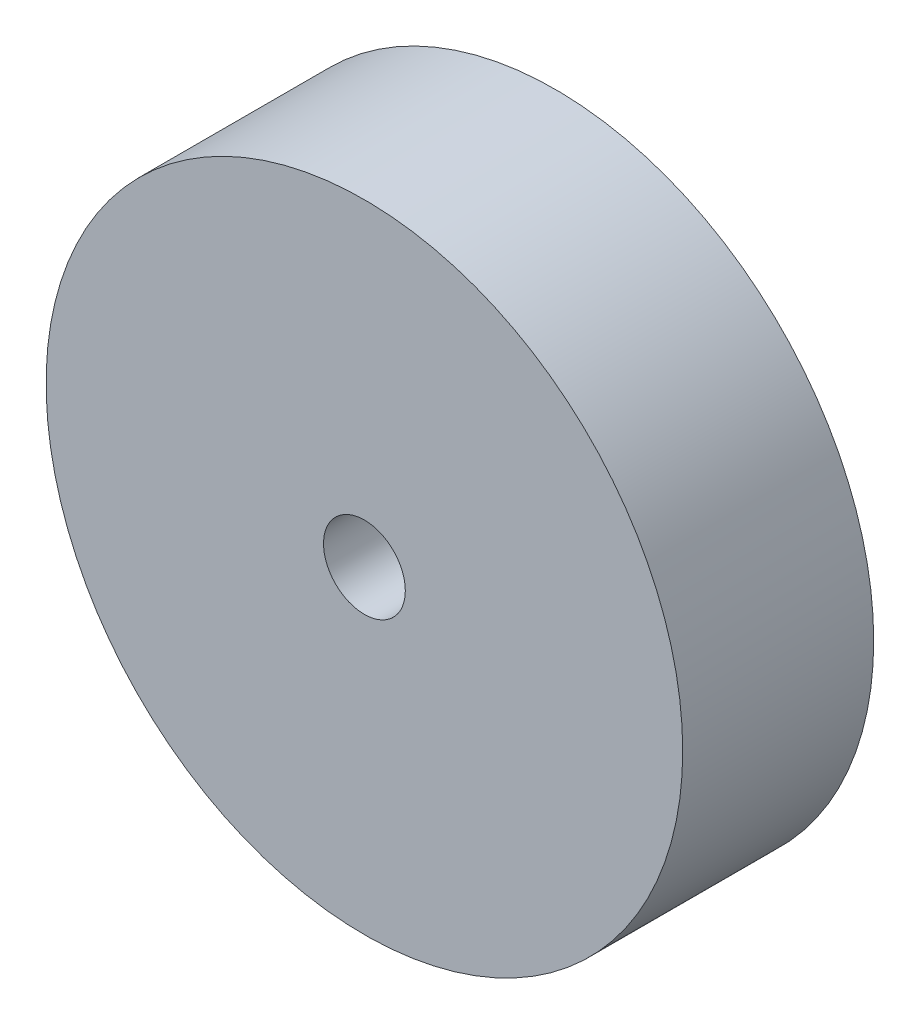
ISO-10303-21;
HEADER;
FILE_DESCRIPTION(('STEP AP214'),'2;1');
FILE_NAME('part.step','',(''),(''),'','','');
FILE_SCHEMA(('AUTOMOTIVE_DESIGN { 1 0 10303 214 1 1 1 1 }'));
ENDSEC;
DATA;
#1=APPLICATION_CONTEXT('core data for automotive mechanical design processes');
#2=APPLICATION_PROTOCOL_DEFINITION('international standard','automotive_design',2000,#1);
#3=PRODUCT_CONTEXT('',#1,'mechanical');
#4=PRODUCT('Part','Part','',(#3));
#5=PRODUCT_RELATED_PRODUCT_CATEGORY('part','',(#4));
#6=PRODUCT_DEFINITION_FORMATION('','',#4);
#7=PRODUCT_DEFINITION_CONTEXT('part definition',#1,'design');
#8=PRODUCT_DEFINITION('design','',#6,#7);
#9=PRODUCT_DEFINITION_SHAPE('','',#8);
#10=(LENGTH_UNIT() NAMED_UNIT(*) SI_UNIT(.MILLI.,.METRE.));
#11=(NAMED_UNIT(*) PLANE_ANGLE_UNIT() SI_UNIT($,.RADIAN.));
#12=(NAMED_UNIT(*) SI_UNIT($,.STERADIAN.) SOLID_ANGLE_UNIT());
#13=UNCERTAINTY_MEASURE_WITH_UNIT(LENGTH_MEASURE(1.E-05),#10,'distance_accuracy_value','');
#14=(GEOMETRIC_REPRESENTATION_CONTEXT(3) GLOBAL_UNCERTAINTY_ASSIGNED_CONTEXT((#13)) GLOBAL_UNIT_ASSIGNED_CONTEXT((#10,
#11,#12)) REPRESENTATION_CONTEXT('',''));
#15=CARTESIAN_POINT('',(0.,0.,0.));
#16=DIRECTION('',(0.,0.,1.));
#17=DIRECTION('',(1.,0.,0.));
#18=AXIS2_PLACEMENT_3D('',#15,#16,#17);
#19=CARTESIAN_POINT('',(0.,0.,7.62));
#20=DIRECTION('',(0.,0.,-1.));
#21=DIRECTION('',(-1.,0.,0.));
#22=AXIS2_PLACEMENT_3D('',#19,#20,#21);
#23=CYLINDRICAL_SURFACE('',#22,12.7);
#24=CARTESIAN_POINT('',(0.,0.,7.62));
#25=DIRECTION('',(0.,0.,1.));
#26=DIRECTION('',(1.,0.,0.));
#27=AXIS2_PLACEMENT_3D('',#24,#25,#26);
#28=CIRCLE('',#27,12.7);
#29=CARTESIAN_POINT('',(12.7,0.,7.62));
#30=VERTEX_POINT('',#29);
#31=EDGE_CURVE('E10',#30,#30,#28,.T.);
#32=ORIENTED_EDGE('',*,*,#31,.F.);
#33=EDGE_LOOP('',(#32));
#34=FACE_BOUND('',#33,.T.);
#35=CARTESIAN_POINT('',(0.,0.,0.));
#36=DIRECTION('',(0.,0.,1.));
#37=DIRECTION('',(1.,0.,0.));
#38=AXIS2_PLACEMENT_3D('',#35,#36,#37);
#39=CIRCLE('',#38,12.7);
#40=CARTESIAN_POINT('',(12.7,0.,0.));
#41=VERTEX_POINT('',#40);
#42=EDGE_CURVE('E34',#41,#41,#39,.T.);
#43=ORIENTED_EDGE('',*,*,#42,.T.);
#44=EDGE_LOOP('',(#43));
#45=FACE_BOUND('',#44,.T.);
#46=ADVANCED_FACE('F31',(#34,#45),#23,.T.);
#47=CARTESIAN_POINT('',(0.,0.,7.62));
#48=DIRECTION('',(0.,0.,1.));
#49=DIRECTION('',(1.,0.,0.));
#50=AXIS2_PLACEMENT_3D('',#47,#48,#49);
#51=PLANE('',#50);
#52=CARTESIAN_POINT('',(0.,0.,7.62));
#53=DIRECTION('',(0.,0.,1.));
#54=DIRECTION('',(1.,0.,0.));
#55=AXIS2_PLACEMENT_3D('',#52,#53,#54);
#56=CIRCLE('',#55,1.63194999999999);
#57=CARTESIAN_POINT('',(1.63194999999999,0.,7.62));
#58=VERTEX_POINT('',#57);
#59=EDGE_CURVE('E45',#58,#58,#56,.T.);
#60=ORIENTED_EDGE('',*,*,#59,.F.);
#61=EDGE_LOOP('',(#60));
#62=FACE_BOUND('',#61,.T.);
#63=ORIENTED_EDGE('',*,*,#31,.T.);
#64=EDGE_LOOP('',(#63));
#65=FACE_BOUND('',#64,.T.);
#66=ADVANCED_FACE('F51',(#62,#65),#51,.T.);
#67=CARTESIAN_POINT('',(0.,0.,0.));
#68=DIRECTION('',(0.,0.,1.));
#69=DIRECTION('',(1.,0.,0.));
#70=AXIS2_PLACEMENT_3D('',#67,#68,#69);
#71=PLANE('',#70);
#72=CARTESIAN_POINT('',(0.,0.,0.));
#73=DIRECTION('',(0.,0.,1.));
#74=DIRECTION('',(1.,0.,0.));
#75=AXIS2_PLACEMENT_3D('',#72,#73,#74);
#76=CIRCLE('',#75,1.63195);
#77=CARTESIAN_POINT('',(1.63195,0.,0.));
#78=VERTEX_POINT('',#77);
#79=EDGE_CURVE('E41',#78,#78,#76,.T.);
#80=ORIENTED_EDGE('',*,*,#79,.T.);
#81=EDGE_LOOP('',(#80));
#82=FACE_BOUND('',#81,.T.);
#83=ORIENTED_EDGE('',*,*,#42,.F.);
#84=EDGE_LOOP('',(#83));
#85=FACE_BOUND('',#84,.T.);
#86=ADVANCED_FACE('F53',(#82,#85),#71,.F.);
#87=CARTESIAN_POINT('',(0.,0.,7.62));
#88=DIRECTION('',(0.,0.,1.));
#89=DIRECTION('',(1.,0.,0.));
#90=AXIS2_PLACEMENT_3D('',#87,#88,#89);
#91=CYLINDRICAL_SURFACE('',#90,1.63194999999999);
#92=ORIENTED_EDGE('',*,*,#79,.F.);
#93=EDGE_LOOP('',(#92));
#94=FACE_BOUND('',#93,.T.);
#95=ORIENTED_EDGE('',*,*,#59,.T.);
#96=EDGE_LOOP('',(#95));
#97=FACE_BOUND('',#96,.T.);
#98=ADVANCED_FACE('F49',(#94,#97),#91,.F.);
#99=CLOSED_SHELL('',(#46,#66,#86,#98));
#100=MANIFOLD_SOLID_BREP('B2',#99);
#101=ADVANCED_BREP_SHAPE_REPRESENTATION('',(#18,#100),#14);
#102=SHAPE_DEFINITION_REPRESENTATION(#9,#101);
ENDSEC;
END-ISO-10303-21;
